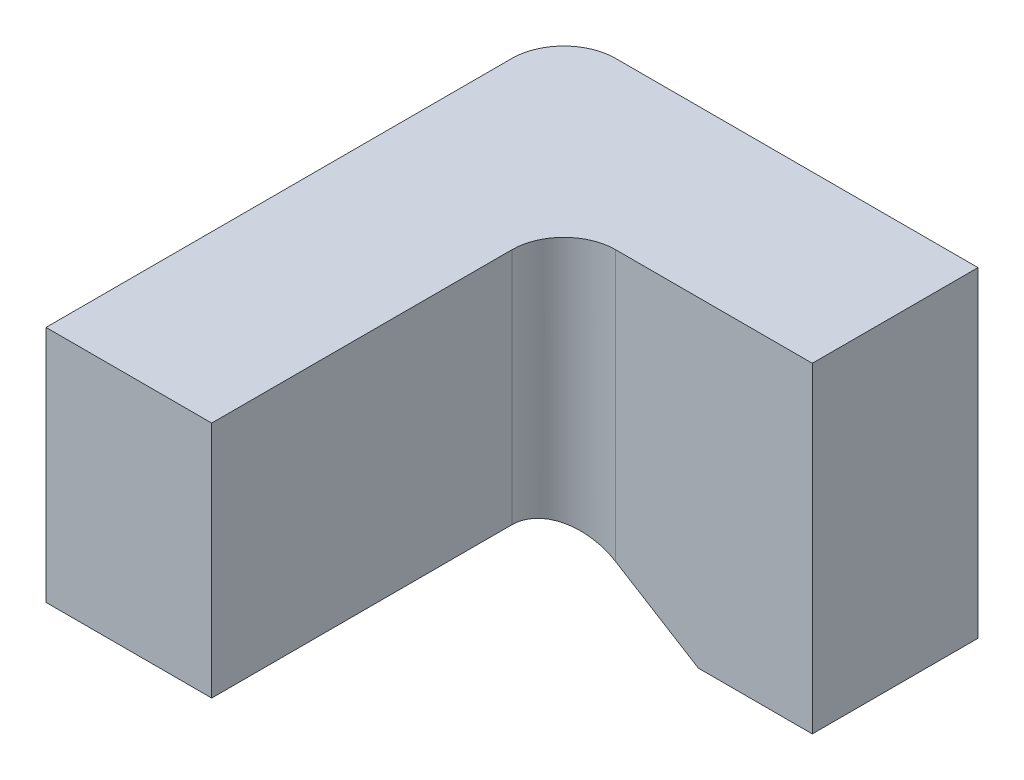
ISO-10303-21;
HEADER;
FILE_DESCRIPTION(('STEP AP214'),'2;1');
FILE_NAME('part.step','',(''),(''),'','','');
FILE_SCHEMA(('AUTOMOTIVE_DESIGN { 1 0 10303 214 1 1 1 1 }'));
ENDSEC;
DATA;
#1=APPLICATION_CONTEXT('core data for automotive mechanical design processes');
#2=APPLICATION_PROTOCOL_DEFINITION('international standard','automotive_design',2000,#1);
#3=PRODUCT_CONTEXT('',#1,'mechanical');
#4=PRODUCT('Part','Part','',(#3));
#5=PRODUCT_RELATED_PRODUCT_CATEGORY('part','',(#4));
#6=PRODUCT_DEFINITION_FORMATION('','',#4);
#7=PRODUCT_DEFINITION_CONTEXT('part definition',#1,'design');
#8=PRODUCT_DEFINITION('design','',#6,#7);
#9=PRODUCT_DEFINITION_SHAPE('','',#8);
#10=(LENGTH_UNIT() NAMED_UNIT(*) SI_UNIT(.MILLI.,.METRE.));
#11=(NAMED_UNIT(*) PLANE_ANGLE_UNIT() SI_UNIT($,.RADIAN.));
#12=(NAMED_UNIT(*) SI_UNIT($,.STERADIAN.) SOLID_ANGLE_UNIT());
#13=UNCERTAINTY_MEASURE_WITH_UNIT(LENGTH_MEASURE(1.E-05),#10,'distance_accuracy_value','');
#14=(GEOMETRIC_REPRESENTATION_CONTEXT(3) GLOBAL_UNCERTAINTY_ASSIGNED_CONTEXT((#13)) GLOBAL_UNIT_ASSIGNED_CONTEXT((#10,
#11,#12)) REPRESENTATION_CONTEXT('',''));
#15=CARTESIAN_POINT('',(0.,0.,0.));
#16=DIRECTION('',(0.,0.,1.));
#17=DIRECTION('',(1.,0.,0.));
#18=AXIS2_PLACEMENT_3D('',#15,#16,#17);
#19=CARTESIAN_POINT('',(0.,0.,0.16));
#20=DIRECTION('',(0.,0.,-1.));
#21=DIRECTION('',(-1.,0.,0.));
#22=AXIS2_PLACEMENT_3D('',#19,#20,#21);
#23=PLANE('',#22);
#24=DIRECTION('',(-1.,0.,0.));
#25=VECTOR('',#24,1.);
#26=CARTESIAN_POINT('',(0.,0.,0.16));
#27=LINE('',#26,#25);
#28=CARTESIAN_POINT('',(0.4,0.,0.16));
#29=VERTEX_POINT('',#28);
#30=CARTESIAN_POINT('',(0.21,0.,0.16));
#31=VERTEX_POINT('',#30);
#32=EDGE_CURVE('E154',#29,#31,#27,.T.);
#33=ORIENTED_EDGE('',*,*,#32,.T.);
#34=DIRECTION('',(0.,1.,0.));
#35=VECTOR('',#34,1.);
#36=CARTESIAN_POINT('',(0.21,-0.23,0.16));
#37=LINE('',#36,#35);
#38=CARTESIAN_POINT('',(0.21,-0.260769230769231,0.16));
#39=VERTEX_POINT('',#38);
#40=EDGE_CURVE('E187',#31,#39,#37,.F.);
#41=ORIENTED_EDGE('',*,*,#40,.T.);
#42=DIRECTION('',(0.851658316704544,-0.524097425664335,0.));
#43=VECTOR('',#42,1.);
#44=CARTESIAN_POINT('',(0.29,-0.31,0.16));
#45=LINE('',#44,#43);
#46=CARTESIAN_POINT('',(0.29,-0.31,0.16));
#47=VERTEX_POINT('',#46);
#48=EDGE_CURVE('E147',#39,#47,#45,.T.);
#49=ORIENTED_EDGE('',*,*,#48,.T.);
#50=DIRECTION('',(1.,0.,0.));
#51=VECTOR('',#50,1.);
#52=CARTESIAN_POINT('',(0.4,-0.31,0.16));
#53=LINE('',#52,#51);
#54=CARTESIAN_POINT('',(0.4,-0.31,0.16));
#55=VERTEX_POINT('',#54);
#56=EDGE_CURVE('E149',#47,#55,#53,.T.);
#57=ORIENTED_EDGE('',*,*,#56,.T.);
#58=DIRECTION('',(0.,1.,0.));
#59=VECTOR('',#58,1.);
#60=CARTESIAN_POINT('',(0.4,0.,0.16));
#61=LINE('',#60,#59);
#62=EDGE_CURVE('E152',#55,#29,#61,.T.);
#63=ORIENTED_EDGE('',*,*,#62,.T.);
#64=EDGE_LOOP('',(#33,#41,#49,#57,#63));
#65=FACE_BOUND('',#64,.T.);
#66=ADVANCED_FACE('F43',(#65),#23,.F.);
#67=CARTESIAN_POINT('',(0.,-0.23,0.16));
#68=DIRECTION('',(1.,0.,0.));
#69=DIRECTION('',(0.,0.,-1.));
#70=AXIS2_PLACEMENT_3D('',#67,#68,#69);
#71=PLANE('',#70);
#72=DIRECTION('',(0.,0.,-1.));
#73=VECTOR('',#72,1.);
#74=CARTESIAN_POINT('',(0.,0.,0.16));
#75=LINE('',#74,#73);
#76=CARTESIAN_POINT('',(0.,0.,0.5));
#77=VERTEX_POINT('',#76);
#78=CARTESIAN_POINT('',(0.,0.,0.05));
#79=VERTEX_POINT('',#78);
#80=EDGE_CURVE('E156',#77,#79,#75,.T.);
#81=ORIENTED_EDGE('',*,*,#80,.T.);
#82=DIRECTION('',(0.,-1.,0.));
#83=VECTOR('',#82,1.);
#84=CARTESIAN_POINT('',(0.,-0.23,0.05));
#85=LINE('',#84,#83);
#86=CARTESIAN_POINT('',(0.,-0.23,0.05));
#87=VERTEX_POINT('',#86);
#88=EDGE_CURVE('E126',#79,#87,#85,.T.);
#89=ORIENTED_EDGE('',*,*,#88,.T.);
#90=DIRECTION('',(0.,0.,-1.));
#91=VECTOR('',#90,1.);
#92=CARTESIAN_POINT('',(0.,-0.23,0.16));
#93=LINE('',#92,#91);
#94=CARTESIAN_POINT('',(0.,-0.23,0.5));
#95=VERTEX_POINT('',#94);
#96=EDGE_CURVE('E119',#95,#87,#93,.T.);
#97=ORIENTED_EDGE('',*,*,#96,.F.);
#98=DIRECTION('',(0.,-1.,0.));
#99=VECTOR('',#98,1.);
#100=CARTESIAN_POINT('',(0.,0.,0.5));
#101=LINE('',#100,#99);
#102=EDGE_CURVE('E124',#77,#95,#101,.T.);
#103=ORIENTED_EDGE('',*,*,#102,.F.);
#104=EDGE_LOOP('',(#81,#89,#97,#103));
#105=FACE_BOUND('',#104,.T.);
#106=ADVANCED_FACE('F122',(#105),#71,.F.);
#107=CARTESIAN_POINT('',(0.16,-0.23,0.16));
#108=DIRECTION('',(0.,1.,0.));
#109=DIRECTION('',(0.,0.,1.));
#110=AXIS2_PLACEMENT_3D('',#107,#108,#109);
#111=PLANE('',#110);
#112=ORIENTED_EDGE('',*,*,#96,.T.);
#113=CARTESIAN_POINT('',(0.05,-0.23,0.05));
#114=DIRECTION('',(0.,1.,0.));
#115=DIRECTION('',(0.,0.,1.));
#116=AXIS2_PLACEMENT_3D('',#113,#114,#115);
#117=CIRCLE('',#116,0.05);
#118=CARTESIAN_POINT('',(0.05,-0.23,0.));
#119=VERTEX_POINT('',#118);
#120=EDGE_CURVE('E178',#87,#119,#117,.F.);
#121=ORIENTED_EDGE('',*,*,#120,.T.);
#122=DIRECTION('',(1.,0.,0.));
#123=VECTOR('',#122,1.);
#124=CARTESIAN_POINT('',(0.16,-0.23,0.));
#125=LINE('',#124,#123);
#126=CARTESIAN_POINT('',(0.16,-0.23,0.));
#127=VERTEX_POINT('',#126);
#128=EDGE_CURVE('E146',#119,#127,#125,.T.);
#129=ORIENTED_EDGE('',*,*,#128,.T.);
#130=DIRECTION('',(0.,0.,-1.));
#131=VECTOR('',#130,1.);
#132=CARTESIAN_POINT('',(0.16,-0.23,0.16));
#133=LINE('',#132,#131);
#134=CARTESIAN_POINT('',(0.16,-0.23,0.21));
#135=VERTEX_POINT('',#134);
#136=EDGE_CURVE('E58',#135,#127,#133,.T.);
#137=ORIENTED_EDGE('',*,*,#136,.F.);
#138=DIRECTION('',(0.,0.,-1.));
#139=VECTOR('',#138,1.);
#140=CARTESIAN_POINT('',(0.16,-0.23,0.5));
#141=LINE('',#140,#139);
#142=CARTESIAN_POINT('',(0.16,-0.23,0.5));
#143=VERTEX_POINT('',#142);
#144=EDGE_CURVE('E130',#143,#135,#141,.T.);
#145=ORIENTED_EDGE('',*,*,#144,.F.);
#146=DIRECTION('',(1.,0.,0.));
#147=VECTOR('',#146,1.);
#148=CARTESIAN_POINT('',(0.,-0.23,0.5));
#149=LINE('',#148,#147);
#150=EDGE_CURVE('E128',#95,#143,#149,.T.);
#151=ORIENTED_EDGE('',*,*,#150,.F.);
#152=EDGE_LOOP('',(#112,#121,#129,#137,#145,#151));
#153=FACE_BOUND('',#152,.T.);
#154=ADVANCED_FACE('F129',(#153),#111,.F.);
#155=CARTESIAN_POINT('',(0.29,-0.31,0.16));
#156=DIRECTION('',(0.524097425664335,0.851658316704544,0.));
#157=DIRECTION('',(-0.851658316704544,0.524097425664335,0.));
#158=AXIS2_PLACEMENT_3D('',#155,#156,#157);
#159=PLANE('',#158);
#160=DIRECTION('',(0.851658316704544,-0.524097425664335,0.));
#161=VECTOR('',#160,1.);
#162=CARTESIAN_POINT('',(0.29,-0.31,0.));
#163=LINE('',#162,#161);
#164=CARTESIAN_POINT('',(0.29,-0.31,0.));
#165=VERTEX_POINT('',#164);
#166=EDGE_CURVE('E158',#127,#165,#163,.T.);
#167=ORIENTED_EDGE('',*,*,#166,.T.);
#168=DIRECTION('',(0.,0.,-1.));
#169=VECTOR('',#168,1.);
#170=CARTESIAN_POINT('',(0.29,-0.31,0.16));
#171=LINE('',#170,#169);
#172=EDGE_CURVE('E173',#47,#165,#171,.T.);
#173=ORIENTED_EDGE('',*,*,#172,.F.);
#174=ORIENTED_EDGE('',*,*,#48,.F.);
#175=CARTESIAN_POINT('',(0.21,-0.260769230769231,0.21));
#176=DIRECTION('',(0.524097425664335,0.851658316704544,0.));
#177=DIRECTION('',(0.851658316704544,-0.524097425664335,0.));
#178=AXIS2_PLACEMENT_3D('',#175,#176,#177);
#179=ELLIPSE('',#178,0.0587089904710529,0.05);
#180=EDGE_CURVE('E11',#39,#135,#179,.T.);
#181=ORIENTED_EDGE('',*,*,#180,.T.);
#182=ORIENTED_EDGE('',*,*,#136,.T.);
#183=EDGE_LOOP('',(#167,#173,#174,#181,#182));
#184=FACE_BOUND('',#183,.T.);
#185=ADVANCED_FACE('F195',(#184),#159,.F.);
#186=CARTESIAN_POINT('',(0.4,-0.31,0.16));
#187=DIRECTION('',(0.,1.,0.));
#188=DIRECTION('',(-1.,0.,0.));
#189=AXIS2_PLACEMENT_3D('',#186,#187,#188);
#190=PLANE('',#189);
#191=DIRECTION('',(1.,0.,0.));
#192=VECTOR('',#191,1.);
#193=CARTESIAN_POINT('',(0.4,-0.31,0.));
#194=LINE('',#193,#192);
#195=CARTESIAN_POINT('',(0.4,-0.31,0.));
#196=VERTEX_POINT('',#195);
#197=EDGE_CURVE('E160',#165,#196,#194,.T.);
#198=ORIENTED_EDGE('',*,*,#197,.T.);
#199=DIRECTION('',(0.,0.,-1.));
#200=VECTOR('',#199,1.);
#201=CARTESIAN_POINT('',(0.4,-0.31,0.16));
#202=LINE('',#201,#200);
#203=EDGE_CURVE('E170',#55,#196,#202,.T.);
#204=ORIENTED_EDGE('',*,*,#203,.F.);
#205=ORIENTED_EDGE('',*,*,#56,.F.);
#206=ORIENTED_EDGE('',*,*,#172,.T.);
#207=EDGE_LOOP('',(#198,#204,#205,#206));
#208=FACE_BOUND('',#207,.T.);
#209=ADVANCED_FACE('F214',(#208),#190,.F.);
#210=CARTESIAN_POINT('',(0.4,0.,0.16));
#211=DIRECTION('',(-1.,0.,0.));
#212=DIRECTION('',(0.,-1.,0.));
#213=AXIS2_PLACEMENT_3D('',#210,#211,#212);
#214=PLANE('',#213);
#215=DIRECTION('',(0.,1.,0.));
#216=VECTOR('',#215,1.);
#217=CARTESIAN_POINT('',(0.4,0.,0.));
#218=LINE('',#217,#216);
#219=CARTESIAN_POINT('',(0.4,0.,0.));
#220=VERTEX_POINT('',#219);
#221=EDGE_CURVE('E162',#196,#220,#218,.T.);
#222=ORIENTED_EDGE('',*,*,#221,.T.);
#223=DIRECTION('',(0.,0.,-1.));
#224=VECTOR('',#223,1.);
#225=CARTESIAN_POINT('',(0.4,0.,0.16));
#226=LINE('',#225,#224);
#227=EDGE_CURVE('E167',#29,#220,#226,.T.);
#228=ORIENTED_EDGE('',*,*,#227,.F.);
#229=ORIENTED_EDGE('',*,*,#62,.F.);
#230=ORIENTED_EDGE('',*,*,#203,.T.);
#231=EDGE_LOOP('',(#222,#228,#229,#230));
#232=FACE_BOUND('',#231,.T.);
#233=ADVANCED_FACE('F219',(#232),#214,.F.);
#234=CARTESIAN_POINT('',(0.,0.,0.16));
#235=DIRECTION('',(0.,-1.,0.));
#236=DIRECTION('',(0.,0.,-1.));
#237=AXIS2_PLACEMENT_3D('',#234,#235,#236);
#238=PLANE('',#237);
#239=DIRECTION('',(-1.,0.,0.));
#240=VECTOR('',#239,1.);
#241=CARTESIAN_POINT('',(0.,0.,0.));
#242=LINE('',#241,#240);
#243=CARTESIAN_POINT('',(0.05,0.,0.));
#244=VERTEX_POINT('',#243);
#245=EDGE_CURVE('E150',#220,#244,#242,.T.);
#246=ORIENTED_EDGE('',*,*,#245,.T.);
#247=CARTESIAN_POINT('',(0.05,0.,0.05));
#248=DIRECTION('',(0.,-1.,0.));
#249=DIRECTION('',(0.,0.,-1.));
#250=AXIS2_PLACEMENT_3D('',#247,#248,#249);
#251=CIRCLE('',#250,0.05);
#252=EDGE_CURVE('E182',#244,#79,#251,.F.);
#253=ORIENTED_EDGE('',*,*,#252,.T.);
#254=ORIENTED_EDGE('',*,*,#80,.F.);
#255=DIRECTION('',(-1.,0.,0.));
#256=VECTOR('',#255,1.);
#257=CARTESIAN_POINT('',(0.,0.,0.5));
#258=LINE('',#257,#256);
#259=CARTESIAN_POINT('',(0.16,0.,0.5));
#260=VERTEX_POINT('',#259);
#261=EDGE_CURVE('E138',#260,#77,#258,.T.);
#262=ORIENTED_EDGE('',*,*,#261,.F.);
#263=DIRECTION('',(0.,0.,-1.));
#264=VECTOR('',#263,1.);
#265=CARTESIAN_POINT('',(0.16,0.,0.5));
#266=LINE('',#265,#264);
#267=CARTESIAN_POINT('',(0.16,0.,0.21));
#268=VERTEX_POINT('',#267);
#269=EDGE_CURVE('E143',#260,#268,#266,.T.);
#270=ORIENTED_EDGE('',*,*,#269,.T.);
#271=CARTESIAN_POINT('',(0.21,0.,0.21));
#272=DIRECTION('',(0.,-1.,0.));
#273=DIRECTION('',(0.,0.,-1.));
#274=AXIS2_PLACEMENT_3D('',#271,#272,#273);
#275=CIRCLE('',#274,0.05);
#276=EDGE_CURVE('E51',#268,#31,#275,.T.);
#277=ORIENTED_EDGE('',*,*,#276,.T.);
#278=ORIENTED_EDGE('',*,*,#32,.F.);
#279=ORIENTED_EDGE('',*,*,#227,.T.);
#280=EDGE_LOOP('',(#246,#253,#254,#262,#270,#277,#278,#279));
#281=FACE_BOUND('',#280,.T.);
#282=ADVANCED_FACE('F201',(#281),#238,.F.);
#283=CARTESIAN_POINT('',(0.,0.,0.));
#284=DIRECTION('',(0.,0.,-1.));
#285=DIRECTION('',(-1.,0.,0.));
#286=AXIS2_PLACEMENT_3D('',#283,#284,#285);
#287=PLANE('',#286);
#288=ORIENTED_EDGE('',*,*,#128,.F.);
#289=DIRECTION('',(0.,-1.,0.));
#290=VECTOR('',#289,1.);
#291=CARTESIAN_POINT('',(0.05,0.,0.));
#292=LINE('',#291,#290);
#293=EDGE_CURVE('E180',#119,#244,#292,.F.);
#294=ORIENTED_EDGE('',*,*,#293,.T.);
#295=ORIENTED_EDGE('',*,*,#245,.F.);
#296=ORIENTED_EDGE('',*,*,#221,.F.);
#297=ORIENTED_EDGE('',*,*,#197,.F.);
#298=ORIENTED_EDGE('',*,*,#166,.F.);
#299=EDGE_LOOP('',(#288,#294,#295,#296,#297,#298));
#300=FACE_BOUND('',#299,.T.);
#301=ADVANCED_FACE('F209',(#300),#287,.T.);
#302=CARTESIAN_POINT('',(0.16,0.,0.5));
#303=DIRECTION('',(-1.,0.,0.));
#304=DIRECTION('',(0.,-1.,0.));
#305=AXIS2_PLACEMENT_3D('',#302,#303,#304);
#306=PLANE('',#305);
#307=ORIENTED_EDGE('',*,*,#144,.T.);
#308=DIRECTION('',(0.,1.,0.));
#309=VECTOR('',#308,1.);
#310=CARTESIAN_POINT('',(0.16,0.,0.21));
#311=LINE('',#310,#309);
#312=EDGE_CURVE('E184',#135,#268,#311,.T.);
#313=ORIENTED_EDGE('',*,*,#312,.T.);
#314=ORIENTED_EDGE('',*,*,#269,.F.);
#315=DIRECTION('',(0.,1.,0.));
#316=VECTOR('',#315,1.);
#317=CARTESIAN_POINT('',(0.16,0.,0.5));
#318=LINE('',#317,#316);
#319=EDGE_CURVE('E133',#143,#260,#318,.T.);
#320=ORIENTED_EDGE('',*,*,#319,.F.);
#321=EDGE_LOOP('',(#307,#313,#314,#320));
#322=FACE_BOUND('',#321,.T.);
#323=ADVANCED_FACE('F200',(#322),#306,.F.);
#324=CARTESIAN_POINT('',(0.,0.,0.5));
#325=DIRECTION('',(0.,0.,1.));
#326=DIRECTION('',(1.,0.,0.));
#327=AXIS2_PLACEMENT_3D('',#324,#325,#326);
#328=PLANE('',#327);
#329=ORIENTED_EDGE('',*,*,#102,.T.);
#330=ORIENTED_EDGE('',*,*,#150,.T.);
#331=ORIENTED_EDGE('',*,*,#319,.T.);
#332=ORIENTED_EDGE('',*,*,#261,.T.);
#333=EDGE_LOOP('',(#329,#330,#331,#332));
#334=FACE_BOUND('',#333,.T.);
#335=ADVANCED_FACE('F136',(#334),#328,.T.);
#336=CARTESIAN_POINT('',(0.05,-0.23,0.05));
#337=DIRECTION('',(0.,1.,0.));
#338=DIRECTION('',(0.,0.,1.));
#339=AXIS2_PLACEMENT_3D('',#336,#337,#338);
#340=CYLINDRICAL_SURFACE('',#339,0.05);
#341=ORIENTED_EDGE('',*,*,#252,.F.);
#342=ORIENTED_EDGE('',*,*,#293,.F.);
#343=ORIENTED_EDGE('',*,*,#120,.F.);
#344=ORIENTED_EDGE('',*,*,#88,.F.);
#345=EDGE_LOOP('',(#341,#342,#343,#344));
#346=FACE_BOUND('',#345,.T.);
#347=ADVANCED_FACE('F204',(#346),#340,.T.);
#348=CARTESIAN_POINT('',(0.21,0.,0.21));
#349=DIRECTION('',(0.,-1.,0.));
#350=DIRECTION('',(1.,0.,0.));
#351=AXIS2_PLACEMENT_3D('',#348,#349,#350);
#352=CYLINDRICAL_SURFACE('',#351,0.05);
#353=ORIENTED_EDGE('',*,*,#180,.F.);
#354=ORIENTED_EDGE('',*,*,#40,.F.);
#355=ORIENTED_EDGE('',*,*,#276,.F.);
#356=ORIENTED_EDGE('',*,*,#312,.F.);
#357=EDGE_LOOP('',(#353,#354,#355,#356));
#358=FACE_BOUND('',#357,.T.);
#359=ADVANCED_FACE('F45',(#358),#352,.F.);
#360=CLOSED_SHELL('',(#66,#106,#154,#185,#209,#233,#282,#301,#323,#335,#347,#359));
#361=MANIFOLD_SOLID_BREP('B2',#360);
#362=ADVANCED_BREP_SHAPE_REPRESENTATION('',(#18,#361),#14);
#363=SHAPE_DEFINITION_REPRESENTATION(#9,#362);
ENDSEC;
END-ISO-10303-21;
